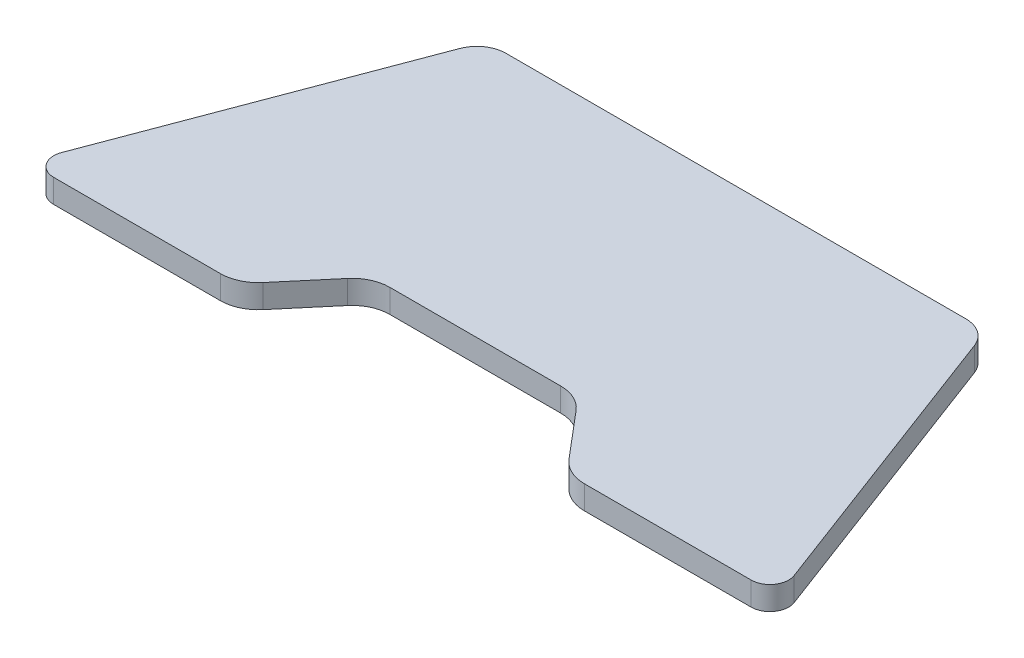
ISO-10303-21;
HEADER;
FILE_DESCRIPTION(('STEP AP214'),'2;1');
FILE_NAME('part.step','',(''),(''),'','','');
FILE_SCHEMA(('AUTOMOTIVE_DESIGN { 1 0 10303 214 1 1 1 1 }'));
ENDSEC;
DATA;
#1=APPLICATION_CONTEXT('core data for automotive mechanical design processes');
#2=APPLICATION_PROTOCOL_DEFINITION('international standard','automotive_design',2000,#1);
#3=PRODUCT_CONTEXT('',#1,'mechanical');
#4=PRODUCT('Part','Part','',(#3));
#5=PRODUCT_RELATED_PRODUCT_CATEGORY('part','',(#4));
#6=PRODUCT_DEFINITION_FORMATION('','',#4);
#7=PRODUCT_DEFINITION_CONTEXT('part definition',#1,'design');
#8=PRODUCT_DEFINITION('design','',#6,#7);
#9=PRODUCT_DEFINITION_SHAPE('','',#8);
#10=(LENGTH_UNIT() NAMED_UNIT(*) SI_UNIT(.MILLI.,.METRE.));
#11=(NAMED_UNIT(*) PLANE_ANGLE_UNIT() SI_UNIT($,.RADIAN.));
#12=(NAMED_UNIT(*) SI_UNIT($,.STERADIAN.) SOLID_ANGLE_UNIT());
#13=UNCERTAINTY_MEASURE_WITH_UNIT(LENGTH_MEASURE(1.E-05),#10,'distance_accuracy_value','');
#14=(GEOMETRIC_REPRESENTATION_CONTEXT(3) GLOBAL_UNCERTAINTY_ASSIGNED_CONTEXT((#13)) GLOBAL_UNIT_ASSIGNED_CONTEXT((#10,
#11,#12)) REPRESENTATION_CONTEXT('',''));
#15=CARTESIAN_POINT('',(0.,0.,0.));
#16=DIRECTION('',(0.,0.,1.));
#17=DIRECTION('',(1.,0.,0.));
#18=AXIS2_PLACEMENT_3D('',#15,#16,#17);
#19=CARTESIAN_POINT('',(0.,5.,-35.5));
#20=DIRECTION('',(0.,0.,-1.));
#21=DIRECTION('',(-1.,0.,0.));
#22=AXIS2_PLACEMENT_3D('',#19,#20,#21);
#23=PLANE('',#22);
#24=DIRECTION('',(1.,0.,0.));
#25=VECTOR('',#24,1.);
#26=CARTESIAN_POINT('',(0.,0.,-35.5));
#27=LINE('',#26,#25);
#28=CARTESIAN_POINT('',(-48.9397162412047,0.,-35.5));
#29=VERTEX_POINT('',#28);
#30=CARTESIAN_POINT('',(48.9397162412047,0.,-35.5));
#31=VERTEX_POINT('',#30);
#32=EDGE_CURVE('E180',#29,#31,#27,.T.);
#33=ORIENTED_EDGE('',*,*,#32,.F.);
#34=DIRECTION('',(0.,-1.,0.));
#35=VECTOR('',#34,1.);
#36=CARTESIAN_POINT('',(-48.9397162412047,5.,-35.5));
#37=LINE('',#36,#35);
#38=CARTESIAN_POINT('',(-48.9397162412047,5.,-35.5));
#39=VERTEX_POINT('',#38);
#40=EDGE_CURVE('E11',#39,#29,#37,.T.);
#41=ORIENTED_EDGE('',*,*,#40,.F.);
#42=DIRECTION('',(1.,0.,0.));
#43=VECTOR('',#42,1.);
#44=CARTESIAN_POINT('',(0.,5.,-35.5));
#45=LINE('',#44,#43);
#46=CARTESIAN_POINT('',(48.9397162412047,5.,-35.5));
#47=VERTEX_POINT('',#46);
#48=EDGE_CURVE('E223',#39,#47,#45,.T.);
#49=ORIENTED_EDGE('',*,*,#48,.T.);
#50=DIRECTION('',(0.,-1.,0.));
#51=VECTOR('',#50,1.);
#52=CARTESIAN_POINT('',(48.9397162412047,5.,-35.5));
#53=LINE('',#52,#51);
#54=EDGE_CURVE('E55',#47,#31,#53,.T.);
#55=ORIENTED_EDGE('',*,*,#54,.T.);
#56=EDGE_LOOP('',(#33,#41,#49,#55));
#57=FACE_BOUND('',#56,.T.);
#58=ADVANCED_FACE('F39',(#57),#23,.T.);
#59=CARTESIAN_POINT('',(-48.9397162412047,5.,-29.27));
#60=DIRECTION('',(0.,-1.,0.));
#61=DIRECTION('',(0.,0.,-1.));
#62=AXIS2_PLACEMENT_3D('',#59,#60,#61);
#63=CYLINDRICAL_SURFACE('',#62,6.23);
#64=CARTESIAN_POINT('',(-48.9397162412047,0.,-29.27));
#65=DIRECTION('',(0.,1.,0.));
#66=DIRECTION('',(0.,0.,1.));
#67=AXIS2_PLACEMENT_3D('',#64,#65,#66);
#68=CIRCLE('',#67,6.23);
#69=CARTESIAN_POINT('',(-54.7696656125678,0.,-31.4664950096333));
#70=VERTEX_POINT('',#69);
#71=EDGE_CURVE('E182',#29,#70,#68,.T.);
#72=ORIENTED_EDGE('',*,*,#71,.T.);
#73=DIRECTION('',(0.,-1.,0.));
#74=VECTOR('',#73,1.);
#75=CARTESIAN_POINT('',(-54.7696656125678,5.,-31.4664950096333));
#76=LINE('',#75,#74);
#77=CARTESIAN_POINT('',(-54.7696656125678,5.,-31.4664950096333));
#78=VERTEX_POINT('',#77);
#79=EDGE_CURVE('E47',#78,#70,#76,.T.);
#80=ORIENTED_EDGE('',*,*,#79,.F.);
#81=CARTESIAN_POINT('',(-48.9397162412047,5.,-29.27));
#82=DIRECTION('',(0.,1.,0.));
#83=DIRECTION('',(0.,0.,1.));
#84=AXIS2_PLACEMENT_3D('',#81,#82,#83);
#85=CIRCLE('',#84,6.23);
#86=EDGE_CURVE('E270',#39,#78,#85,.T.);
#87=ORIENTED_EDGE('',*,*,#86,.F.);
#88=ORIENTED_EDGE('',*,*,#40,.T.);
#89=EDGE_LOOP('',(#72,#80,#87,#88));
#90=FACE_BOUND('',#89,.T.);
#91=ADVANCED_FACE('F306',(#90),#63,.T.);
#92=CARTESIAN_POINT('',(-58.3432604093155,5.,-21.9814396612562));
#93=DIRECTION('',(0.935786415949122,0.,0.352567417276606));
#94=DIRECTION('',(0.352567417276606,0.,-0.935786415949122));
#95=AXIS2_PLACEMENT_3D('',#92,#93,#94);
#96=PLANE('',#95);
#97=DIRECTION('',(-0.352567417276606,0.,0.935786415949122));
#98=VECTOR('',#97,1.);
#99=CARTESIAN_POINT('',(-58.3432604093155,0.,-21.9814396612562));
#100=LINE('',#99,#98);
#101=CARTESIAN_POINT('',(-77.9616237514282,0.,30.0897303308935));
#102=VERTEX_POINT('',#101);
#103=EDGE_CURVE('E184',#70,#102,#100,.T.);
#104=ORIENTED_EDGE('',*,*,#103,.T.);
#105=DIRECTION('',(0.,-1.,0.));
#106=VECTOR('',#105,1.);
#107=CARTESIAN_POINT('',(-77.9616237514282,5.,30.0897303308935));
#108=LINE('',#107,#106);
#109=CARTESIAN_POINT('',(-77.9616237514282,5.,30.0897303308935));
#110=VERTEX_POINT('',#109);
#111=EDGE_CURVE('E245',#110,#102,#108,.T.);
#112=ORIENTED_EDGE('',*,*,#111,.F.);
#113=DIRECTION('',(-0.352567417276606,0.,0.935786415949122));
#114=VECTOR('',#113,1.);
#115=CARTESIAN_POINT('',(-58.3432604093155,5.,-21.9814396612562));
#116=LINE('',#115,#114);
#117=EDGE_CURVE('E253',#78,#110,#116,.T.);
#118=ORIENTED_EDGE('',*,*,#117,.F.);
#119=ORIENTED_EDGE('',*,*,#79,.T.);
#120=EDGE_LOOP('',(#104,#112,#118,#119));
#121=FACE_BOUND('',#120,.T.);
#122=ADVANCED_FACE('F251',(#121),#96,.F.);
#123=CARTESIAN_POINT('',(-74.2184780876317,5.,31.5));
#124=DIRECTION('',(0.,-1.,0.));
#125=DIRECTION('',(0.,0.,-1.));
#126=AXIS2_PLACEMENT_3D('',#123,#124,#125);
#127=CYLINDRICAL_SURFACE('',#126,4.);
#128=CARTESIAN_POINT('',(-74.2184780876317,0.,31.5));
#129=DIRECTION('',(0.,1.,0.));
#130=DIRECTION('',(0.,0.,1.));
#131=AXIS2_PLACEMENT_3D('',#128,#129,#130);
#132=CIRCLE('',#131,4.);
#133=CARTESIAN_POINT('',(-74.2184780876317,0.,35.5));
#134=VERTEX_POINT('',#133);
#135=EDGE_CURVE('E187',#134,#102,#132,.F.);
#136=ORIENTED_EDGE('',*,*,#135,.F.);
#137=DIRECTION('',(0.,-1.,0.));
#138=VECTOR('',#137,1.);
#139=CARTESIAN_POINT('',(-74.2184780876317,5.,35.5));
#140=LINE('',#139,#138);
#141=CARTESIAN_POINT('',(-74.2184780876317,5.,35.5));
#142=VERTEX_POINT('',#141);
#143=EDGE_CURVE('E243',#142,#134,#140,.T.);
#144=ORIENTED_EDGE('',*,*,#143,.F.);
#145=CARTESIAN_POINT('',(-74.2184780876317,5.,31.5));
#146=DIRECTION('',(0.,1.,0.));
#147=DIRECTION('',(0.,0.,1.));
#148=AXIS2_PLACEMENT_3D('',#145,#146,#147);
#149=CIRCLE('',#148,4.);
#150=EDGE_CURVE('E265',#142,#110,#149,.F.);
#151=ORIENTED_EDGE('',*,*,#150,.T.);
#152=ORIENTED_EDGE('',*,*,#111,.T.);
#153=EDGE_LOOP('',(#136,#144,#151,#152));
#154=FACE_BOUND('',#153,.T.);
#155=ADVANCED_FACE('F261',(#154),#127,.T.);
#156=CARTESIAN_POINT('',(0.,5.,35.5));
#157=DIRECTION('',(0.,0.,-1.));
#158=DIRECTION('',(-1.,0.,0.));
#159=AXIS2_PLACEMENT_3D('',#156,#157,#158);
#160=PLANE('',#159);
#161=DIRECTION('',(1.,0.,0.));
#162=VECTOR('',#161,1.);
#163=CARTESIAN_POINT('',(0.,0.,35.5));
#164=LINE('',#163,#162);
#165=CARTESIAN_POINT('',(-38.7609681740562,0.,35.5));
#166=VERTEX_POINT('',#165);
#167=EDGE_CURVE('E190',#134,#166,#164,.T.);
#168=ORIENTED_EDGE('',*,*,#167,.T.);
#169=DIRECTION('',(0.,-1.,0.));
#170=VECTOR('',#169,1.);
#171=CARTESIAN_POINT('',(-38.7609681740562,5.,35.5));
#172=LINE('',#171,#170);
#173=CARTESIAN_POINT('',(-38.7609681740562,5.,35.5));
#174=VERTEX_POINT('',#173);
#175=EDGE_CURVE('E241',#174,#166,#172,.T.);
#176=ORIENTED_EDGE('',*,*,#175,.F.);
#177=DIRECTION('',(1.,0.,0.));
#178=VECTOR('',#177,1.);
#179=CARTESIAN_POINT('',(0.,5.,35.5));
#180=LINE('',#179,#178);
#181=EDGE_CURVE('E266',#142,#174,#180,.T.);
#182=ORIENTED_EDGE('',*,*,#181,.F.);
#183=ORIENTED_EDGE('',*,*,#143,.T.);
#184=EDGE_LOOP('',(#168,#176,#182,#183));
#185=FACE_BOUND('',#184,.T.);
#186=ADVANCED_FACE('F317',(#185),#160,.F.);
#187=CARTESIAN_POINT('',(-38.7609681740562,5.,27.4));
#188=DIRECTION('',(0.,-1.,0.));
#189=DIRECTION('',(0.,0.,-1.));
#190=AXIS2_PLACEMENT_3D('',#187,#188,#189);
#191=CYLINDRICAL_SURFACE('',#190,8.1);
#192=CARTESIAN_POINT('',(-38.7609681740562,0.,27.4));
#193=DIRECTION('',(0.,1.,0.));
#194=DIRECTION('',(0.,0.,1.));
#195=AXIS2_PLACEMENT_3D('',#192,#193,#194);
#196=CIRCLE('',#195,8.1);
#197=CARTESIAN_POINT('',(-32.573080563163,0.,32.626858226024));
#198=VERTEX_POINT('',#197);
#199=EDGE_CURVE('E193',#198,#166,#196,.F.);
#200=ORIENTED_EDGE('',*,*,#199,.F.);
#201=DIRECTION('',(0.,-1.,0.));
#202=VECTOR('',#201,1.);
#203=CARTESIAN_POINT('',(-32.573080563163,5.,32.626858226024));
#204=LINE('',#203,#202);
#205=CARTESIAN_POINT('',(-32.573080563163,5.,32.626858226024));
#206=VERTEX_POINT('',#205);
#207=EDGE_CURVE('E239',#206,#198,#204,.T.);
#208=ORIENTED_EDGE('',*,*,#207,.F.);
#209=CARTESIAN_POINT('',(-38.7609681740562,5.,27.4));
#210=DIRECTION('',(0.,1.,0.));
#211=DIRECTION('',(0.,0.,1.));
#212=AXIS2_PLACEMENT_3D('',#209,#210,#211);
#213=CIRCLE('',#212,8.1);
#214=EDGE_CURVE('E268',#206,#174,#213,.F.);
#215=ORIENTED_EDGE('',*,*,#214,.T.);
#216=ORIENTED_EDGE('',*,*,#175,.T.);
#217=EDGE_LOOP('',(#200,#208,#215,#216));
#218=FACE_BOUND('',#217,.T.);
#219=ADVANCED_FACE('F320',(#218),#191,.T.);
#220=CARTESIAN_POINT('',(-2.92583993631155,5.,-2.47143314500702));
#221=DIRECTION('',(-0.763936742085573,0.,-0.645291139015313));
#222=DIRECTION('',(-0.645291139015313,0.,0.763936742085573));
#223=AXIS2_PLACEMENT_3D('',#220,#221,#222);
#224=PLANE('',#223);
#225=DIRECTION('',(0.645291139015313,0.,-0.763936742085573));
#226=VECTOR('',#225,1.);
#227=CARTESIAN_POINT('',(-2.92583993631155,0.,-2.47143314500702));
#228=LINE('',#227,#226);
#229=CARTESIAN_POINT('',(-24.3042338125517,0.,22.8376708878775));
#230=VERTEX_POINT('',#229);
#231=EDGE_CURVE('E196',#198,#230,#228,.T.);
#232=ORIENTED_EDGE('',*,*,#231,.T.);
#233=DIRECTION('',(0.,-1.,0.));
#234=VECTOR('',#233,1.);
#235=CARTESIAN_POINT('',(-24.3042338125517,5.,22.8376708878775));
#236=LINE('',#235,#234);
#237=CARTESIAN_POINT('',(-24.3042338125517,5.,22.8376708878775));
#238=VERTEX_POINT('',#237);
#239=EDGE_CURVE('E237',#238,#230,#236,.T.);
#240=ORIENTED_EDGE('',*,*,#239,.F.);
#241=DIRECTION('',(0.645291139015313,0.,-0.763936742085573));
#242=VECTOR('',#241,1.);
#243=CARTESIAN_POINT('',(-2.92583993631155,5.,-2.47143314500702));
#244=LINE('',#243,#242);
#245=EDGE_CURVE('E276',#206,#238,#244,.T.);
#246=ORIENTED_EDGE('',*,*,#245,.F.);
#247=ORIENTED_EDGE('',*,*,#207,.T.);
#248=EDGE_LOOP('',(#232,#240,#246,#247));
#249=FACE_BOUND('',#248,.T.);
#250=ADVANCED_FACE('F324',(#249),#224,.F.);
#251=CARTESIAN_POINT('',(-18.1927398758671,5.,28.));
#252=DIRECTION('',(0.,-1.,0.));
#253=DIRECTION('',(0.,0.,-1.));
#254=AXIS2_PLACEMENT_3D('',#251,#252,#253);
#255=CYLINDRICAL_SURFACE('',#254,8.);
#256=CARTESIAN_POINT('',(-18.1927398758671,0.,28.));
#257=DIRECTION('',(0.,1.,0.));
#258=DIRECTION('',(0.,0.,1.));
#259=AXIS2_PLACEMENT_3D('',#256,#257,#258);
#260=CIRCLE('',#259,8.);
#261=CARTESIAN_POINT('',(-18.1927398758671,0.,20.));
#262=VERTEX_POINT('',#261);
#263=EDGE_CURVE('E199',#262,#230,#260,.T.);
#264=ORIENTED_EDGE('',*,*,#263,.F.);
#265=DIRECTION('',(0.,-1.,0.));
#266=VECTOR('',#265,1.);
#267=CARTESIAN_POINT('',(-18.1927398758671,5.,20.));
#268=LINE('',#267,#266);
#269=CARTESIAN_POINT('',(-18.1927398758671,5.,20.));
#270=VERTEX_POINT('',#269);
#271=EDGE_CURVE('E235',#270,#262,#268,.T.);
#272=ORIENTED_EDGE('',*,*,#271,.F.);
#273=CARTESIAN_POINT('',(-18.1927398758671,5.,28.));
#274=DIRECTION('',(0.,1.,0.));
#275=DIRECTION('',(0.,0.,1.));
#276=AXIS2_PLACEMENT_3D('',#273,#274,#275);
#277=CIRCLE('',#276,8.);
#278=EDGE_CURVE('E278',#270,#238,#277,.T.);
#279=ORIENTED_EDGE('',*,*,#278,.T.);
#280=ORIENTED_EDGE('',*,*,#239,.T.);
#281=EDGE_LOOP('',(#264,#272,#279,#280));
#282=FACE_BOUND('',#281,.T.);
#283=ADVANCED_FACE('F328',(#282),#255,.F.);
#284=CARTESIAN_POINT('',(0.,5.,20.));
#285=DIRECTION('',(0.,0.,1.));
#286=DIRECTION('',(1.,0.,0.));
#287=AXIS2_PLACEMENT_3D('',#284,#285,#286);
#288=PLANE('',#287);
#289=DIRECTION('',(-1.,0.,0.));
#290=VECTOR('',#289,1.);
#291=CARTESIAN_POINT('',(0.,0.,20.));
#292=LINE('',#291,#290);
#293=CARTESIAN_POINT('',(18.1927398758671,0.,20.));
#294=VERTEX_POINT('',#293);
#295=EDGE_CURVE('E202',#294,#262,#292,.T.);
#296=ORIENTED_EDGE('',*,*,#295,.F.);
#297=DIRECTION('',(0.,-1.,0.));
#298=VECTOR('',#297,1.);
#299=CARTESIAN_POINT('',(18.1927398758671,5.,20.));
#300=LINE('',#299,#298);
#301=CARTESIAN_POINT('',(18.1927398758671,5.,20.));
#302=VERTEX_POINT('',#301);
#303=EDGE_CURVE('E233',#302,#294,#300,.T.);
#304=ORIENTED_EDGE('',*,*,#303,.F.);
#305=DIRECTION('',(-1.,0.,0.));
#306=VECTOR('',#305,1.);
#307=CARTESIAN_POINT('',(0.,5.,20.));
#308=LINE('',#307,#306);
#309=EDGE_CURVE('E281',#302,#270,#308,.T.);
#310=ORIENTED_EDGE('',*,*,#309,.T.);
#311=ORIENTED_EDGE('',*,*,#271,.T.);
#312=EDGE_LOOP('',(#296,#304,#310,#311));
#313=FACE_BOUND('',#312,.T.);
#314=ADVANCED_FACE('F332',(#313),#288,.T.);
#315=CARTESIAN_POINT('',(18.1927398758671,5.,28.));
#316=DIRECTION('',(0.,-1.,0.));
#317=DIRECTION('',(0.,0.,-1.));
#318=AXIS2_PLACEMENT_3D('',#315,#316,#317);
#319=CYLINDRICAL_SURFACE('',#318,8.);
#320=CARTESIAN_POINT('',(18.1927398758671,0.,28.));
#321=DIRECTION('',(0.,1.,0.));
#322=DIRECTION('',(0.,0.,1.));
#323=AXIS2_PLACEMENT_3D('',#320,#321,#322);
#324=CIRCLE('',#323,8.);
#325=CARTESIAN_POINT('',(24.3042338125517,0.,22.8376708878775));
#326=VERTEX_POINT('',#325);
#327=EDGE_CURVE('E205',#294,#326,#324,.F.);
#328=ORIENTED_EDGE('',*,*,#327,.T.);
#329=DIRECTION('',(0.,-1.,0.));
#330=VECTOR('',#329,1.);
#331=CARTESIAN_POINT('',(24.3042338125517,5.,22.8376708878775));
#332=LINE('',#331,#330);
#333=CARTESIAN_POINT('',(24.3042338125517,5.,22.8376708878775));
#334=VERTEX_POINT('',#333);
#335=EDGE_CURVE('E231',#334,#326,#332,.T.);
#336=ORIENTED_EDGE('',*,*,#335,.F.);
#337=CARTESIAN_POINT('',(18.1927398758671,5.,28.));
#338=DIRECTION('',(0.,1.,0.));
#339=DIRECTION('',(0.,0.,1.));
#340=AXIS2_PLACEMENT_3D('',#337,#338,#339);
#341=CIRCLE('',#340,8.);
#342=EDGE_CURVE('E284',#302,#334,#341,.F.);
#343=ORIENTED_EDGE('',*,*,#342,.F.);
#344=ORIENTED_EDGE('',*,*,#303,.T.);
#345=EDGE_LOOP('',(#328,#336,#343,#344));
#346=FACE_BOUND('',#345,.T.);
#347=ADVANCED_FACE('F336',(#346),#319,.F.);
#348=CARTESIAN_POINT('',(2.92583993631156,5.,-2.47143314500703));
#349=DIRECTION('',(-0.763936742085573,0.,0.645291139015313));
#350=DIRECTION('',(0.645291139015313,0.,0.763936742085573));
#351=AXIS2_PLACEMENT_3D('',#348,#349,#350);
#352=PLANE('',#351);
#353=DIRECTION('',(-0.645291139015313,0.,-0.763936742085573));
#354=VECTOR('',#353,1.);
#355=CARTESIAN_POINT('',(2.92583993631156,0.,-2.47143314500703));
#356=LINE('',#355,#354);
#357=CARTESIAN_POINT('',(32.573080563163,0.,32.626858226024));
#358=VERTEX_POINT('',#357);
#359=EDGE_CURVE('E208',#358,#326,#356,.T.);
#360=ORIENTED_EDGE('',*,*,#359,.F.);
#361=DIRECTION('',(0.,-1.,0.));
#362=VECTOR('',#361,1.);
#363=CARTESIAN_POINT('',(32.573080563163,5.,32.626858226024));
#364=LINE('',#363,#362);
#365=CARTESIAN_POINT('',(32.573080563163,5.,32.626858226024));
#366=VERTEX_POINT('',#365);
#367=EDGE_CURVE('E229',#366,#358,#364,.T.);
#368=ORIENTED_EDGE('',*,*,#367,.F.);
#369=DIRECTION('',(-0.645291139015313,0.,-0.763936742085573));
#370=VECTOR('',#369,1.);
#371=CARTESIAN_POINT('',(2.92583993631156,5.,-2.47143314500703));
#372=LINE('',#371,#370);
#373=EDGE_CURVE('E286',#366,#334,#372,.T.);
#374=ORIENTED_EDGE('',*,*,#373,.T.);
#375=ORIENTED_EDGE('',*,*,#335,.T.);
#376=EDGE_LOOP('',(#360,#368,#374,#375));
#377=FACE_BOUND('',#376,.T.);
#378=ADVANCED_FACE('F340',(#377),#352,.T.);
#379=CARTESIAN_POINT('',(38.7609681740562,5.,27.4));
#380=DIRECTION('',(0.,-1.,0.));
#381=DIRECTION('',(0.,0.,-1.));
#382=AXIS2_PLACEMENT_3D('',#379,#380,#381);
#383=CYLINDRICAL_SURFACE('',#382,8.10000000000001);
#384=CARTESIAN_POINT('',(38.7609681740562,0.,27.4));
#385=DIRECTION('',(0.,1.,0.));
#386=DIRECTION('',(0.,0.,1.));
#387=AXIS2_PLACEMENT_3D('',#384,#385,#386);
#388=CIRCLE('',#387,8.10000000000001);
#389=CARTESIAN_POINT('',(38.7609681740562,0.,35.5));
#390=VERTEX_POINT('',#389);
#391=EDGE_CURVE('E211',#358,#390,#388,.T.);
#392=ORIENTED_EDGE('',*,*,#391,.T.);
#393=DIRECTION('',(0.,-1.,0.));
#394=VECTOR('',#393,1.);
#395=CARTESIAN_POINT('',(38.7609681740562,5.,35.5));
#396=LINE('',#395,#394);
#397=CARTESIAN_POINT('',(38.7609681740562,5.,35.5));
#398=VERTEX_POINT('',#397);
#399=EDGE_CURVE('E227',#398,#390,#396,.T.);
#400=ORIENTED_EDGE('',*,*,#399,.F.);
#401=CARTESIAN_POINT('',(38.7609681740562,5.,27.4));
#402=DIRECTION('',(0.,1.,0.));
#403=DIRECTION('',(0.,0.,1.));
#404=AXIS2_PLACEMENT_3D('',#401,#402,#403);
#405=CIRCLE('',#404,8.10000000000001);
#406=EDGE_CURVE('E289',#366,#398,#405,.T.);
#407=ORIENTED_EDGE('',*,*,#406,.F.);
#408=ORIENTED_EDGE('',*,*,#367,.T.);
#409=EDGE_LOOP('',(#392,#400,#407,#408));
#410=FACE_BOUND('',#409,.T.);
#411=ADVANCED_FACE('F344',(#410),#383,.T.);
#412=CARTESIAN_POINT('',(0.,5.,35.5));
#413=DIRECTION('',(0.,0.,1.));
#414=DIRECTION('',(1.,0.,0.));
#415=AXIS2_PLACEMENT_3D('',#412,#413,#414);
#416=PLANE('',#415);
#417=DIRECTION('',(-1.,0.,0.));
#418=VECTOR('',#417,1.);
#419=CARTESIAN_POINT('',(0.,0.,35.5));
#420=LINE('',#419,#418);
#421=CARTESIAN_POINT('',(74.2184780876317,0.,35.5));
#422=VERTEX_POINT('',#421);
#423=EDGE_CURVE('E214',#422,#390,#420,.T.);
#424=ORIENTED_EDGE('',*,*,#423,.F.);
#425=DIRECTION('',(0.,-1.,0.));
#426=VECTOR('',#425,1.);
#427=CARTESIAN_POINT('',(74.2184780876317,5.,35.5));
#428=LINE('',#427,#426);
#429=CARTESIAN_POINT('',(74.2184780876317,5.,35.5));
#430=VERTEX_POINT('',#429);
#431=EDGE_CURVE('E172',#430,#422,#428,.T.);
#432=ORIENTED_EDGE('',*,*,#431,.F.);
#433=DIRECTION('',(-1.,0.,0.));
#434=VECTOR('',#433,1.);
#435=CARTESIAN_POINT('',(0.,5.,35.5));
#436=LINE('',#435,#434);
#437=EDGE_CURVE('E162',#430,#398,#436,.T.);
#438=ORIENTED_EDGE('',*,*,#437,.T.);
#439=ORIENTED_EDGE('',*,*,#399,.T.);
#440=EDGE_LOOP('',(#424,#432,#438,#439));
#441=FACE_BOUND('',#440,.T.);
#442=ADVANCED_FACE('F292',(#441),#416,.T.);
#443=CARTESIAN_POINT('',(74.2184780876317,5.,31.5));
#444=DIRECTION('',(0.,-1.,0.));
#445=DIRECTION('',(0.,0.,-1.));
#446=AXIS2_PLACEMENT_3D('',#443,#444,#445);
#447=CYLINDRICAL_SURFACE('',#446,3.99999999999997);
#448=CARTESIAN_POINT('',(74.2184780876317,0.,31.5));
#449=DIRECTION('',(0.,1.,0.));
#450=DIRECTION('',(0.,0.,1.));
#451=AXIS2_PLACEMENT_3D('',#448,#449,#450);
#452=CIRCLE('',#451,3.99999999999997);
#453=CARTESIAN_POINT('',(77.9616237514282,0.,30.0897303308935));
#454=VERTEX_POINT('',#453);
#455=EDGE_CURVE('E169',#422,#454,#452,.T.);
#456=ORIENTED_EDGE('',*,*,#455,.T.);
#457=DIRECTION('',(0.,-1.,0.));
#458=VECTOR('',#457,1.);
#459=CARTESIAN_POINT('',(77.9616237514282,5.,30.0897303308935));
#460=LINE('',#459,#458);
#461=CARTESIAN_POINT('',(77.9616237514282,5.,30.0897303308935));
#462=VERTEX_POINT('',#461);
#463=EDGE_CURVE('E166',#462,#454,#460,.T.);
#464=ORIENTED_EDGE('',*,*,#463,.F.);
#465=CARTESIAN_POINT('',(74.2184780876317,5.,31.5));
#466=DIRECTION('',(0.,1.,0.));
#467=DIRECTION('',(0.,0.,1.));
#468=AXIS2_PLACEMENT_3D('',#465,#466,#467);
#469=CIRCLE('',#468,3.99999999999997);
#470=EDGE_CURVE('E154',#430,#462,#469,.T.);
#471=ORIENTED_EDGE('',*,*,#470,.F.);
#472=ORIENTED_EDGE('',*,*,#431,.T.);
#473=EDGE_LOOP('',(#456,#464,#471,#472));
#474=FACE_BOUND('',#473,.T.);
#475=ADVANCED_FACE('F167',(#474),#447,.T.);
#476=CARTESIAN_POINT('',(58.3432604093155,5.,-21.9814396612562));
#477=DIRECTION('',(0.935786415949122,0.,-0.352567417276606));
#478=DIRECTION('',(-0.352567417276606,0.,-0.935786415949122));
#479=AXIS2_PLACEMENT_3D('',#476,#477,#478);
#480=PLANE('',#479);
#481=DIRECTION('',(0.352567417276606,0.,0.935786415949122));
#482=VECTOR('',#481,1.);
#483=CARTESIAN_POINT('',(58.3432604093155,0.,-21.9814396612562));
#484=LINE('',#483,#482);
#485=CARTESIAN_POINT('',(54.7696656125678,0.,-31.4664950096333));
#486=VERTEX_POINT('',#485);
#487=EDGE_CURVE('E218',#486,#454,#484,.T.);
#488=ORIENTED_EDGE('',*,*,#487,.F.);
#489=DIRECTION('',(0.,-1.,0.));
#490=VECTOR('',#489,1.);
#491=CARTESIAN_POINT('',(54.7696656125678,5.,-31.4664950096333));
#492=LINE('',#491,#490);
#493=CARTESIAN_POINT('',(54.7696656125678,5.,-31.4664950096333));
#494=VERTEX_POINT('',#493);
#495=EDGE_CURVE('E104',#494,#486,#492,.T.);
#496=ORIENTED_EDGE('',*,*,#495,.F.);
#497=DIRECTION('',(0.352567417276606,0.,0.935786415949122));
#498=VECTOR('',#497,1.);
#499=CARTESIAN_POINT('',(58.3432604093155,5.,-21.9814396612562));
#500=LINE('',#499,#498);
#501=EDGE_CURVE('E160',#494,#462,#500,.T.);
#502=ORIENTED_EDGE('',*,*,#501,.T.);
#503=ORIENTED_EDGE('',*,*,#463,.T.);
#504=EDGE_LOOP('',(#488,#496,#502,#503));
#505=FACE_BOUND('',#504,.T.);
#506=ADVANCED_FACE('F174',(#505),#480,.T.);
#507=CARTESIAN_POINT('',(48.9397162412047,5.,-29.27));
#508=DIRECTION('',(0.,-1.,0.));
#509=DIRECTION('',(0.,0.,-1.));
#510=AXIS2_PLACEMENT_3D('',#507,#508,#509);
#511=CYLINDRICAL_SURFACE('',#510,6.23);
#512=CARTESIAN_POINT('',(48.9397162412047,0.,-29.27));
#513=DIRECTION('',(0.,1.,0.));
#514=DIRECTION('',(0.,0.,1.));
#515=AXIS2_PLACEMENT_3D('',#512,#513,#514);
#516=CIRCLE('',#515,6.23);
#517=EDGE_CURVE('E220',#31,#486,#516,.F.);
#518=ORIENTED_EDGE('',*,*,#517,.F.);
#519=ORIENTED_EDGE('',*,*,#54,.F.);
#520=CARTESIAN_POINT('',(48.9397162412047,5.,-29.27));
#521=DIRECTION('',(0.,1.,0.));
#522=DIRECTION('',(0.,0.,1.));
#523=AXIS2_PLACEMENT_3D('',#520,#521,#522);
#524=CIRCLE('',#523,6.23);
#525=EDGE_CURVE('E175',#47,#494,#524,.F.);
#526=ORIENTED_EDGE('',*,*,#525,.T.);
#527=ORIENTED_EDGE('',*,*,#495,.T.);
#528=EDGE_LOOP('',(#518,#519,#526,#527));
#529=FACE_BOUND('',#528,.T.);
#530=ADVANCED_FACE('F295',(#529),#511,.T.);
#531=CARTESIAN_POINT('',(0.,5.,0.));
#532=DIRECTION('',(0.,1.,0.));
#533=DIRECTION('',(0.,0.,1.));
#534=AXIS2_PLACEMENT_3D('',#531,#532,#533);
#535=PLANE('',#534);
#536=ORIENTED_EDGE('',*,*,#48,.F.);
#537=ORIENTED_EDGE('',*,*,#86,.T.);
#538=ORIENTED_EDGE('',*,*,#117,.T.);
#539=ORIENTED_EDGE('',*,*,#150,.F.);
#540=ORIENTED_EDGE('',*,*,#181,.T.);
#541=ORIENTED_EDGE('',*,*,#214,.F.);
#542=ORIENTED_EDGE('',*,*,#245,.T.);
#543=ORIENTED_EDGE('',*,*,#278,.F.);
#544=ORIENTED_EDGE('',*,*,#309,.F.);
#545=ORIENTED_EDGE('',*,*,#342,.T.);
#546=ORIENTED_EDGE('',*,*,#373,.F.);
#547=ORIENTED_EDGE('',*,*,#406,.T.);
#548=ORIENTED_EDGE('',*,*,#437,.F.);
#549=ORIENTED_EDGE('',*,*,#470,.T.);
#550=ORIENTED_EDGE('',*,*,#501,.F.);
#551=ORIENTED_EDGE('',*,*,#525,.F.);
#552=EDGE_LOOP('',(#536,#537,#538,#539,#540,#541,#542,#543,#544,#545,#546,#547,#548,#549,#550,#551));
#553=FACE_BOUND('',#552,.T.);
#554=ADVANCED_FACE('F157',(#553),#535,.T.);
#555=CARTESIAN_POINT('',(0.,0.,0.));
#556=DIRECTION('',(0.,1.,0.));
#557=DIRECTION('',(0.,0.,1.));
#558=AXIS2_PLACEMENT_3D('',#555,#556,#557);
#559=PLANE('',#558);
#560=ORIENTED_EDGE('',*,*,#32,.T.);
#561=ORIENTED_EDGE('',*,*,#517,.T.);
#562=ORIENTED_EDGE('',*,*,#487,.T.);
#563=ORIENTED_EDGE('',*,*,#455,.F.);
#564=ORIENTED_EDGE('',*,*,#423,.T.);
#565=ORIENTED_EDGE('',*,*,#391,.F.);
#566=ORIENTED_EDGE('',*,*,#359,.T.);
#567=ORIENTED_EDGE('',*,*,#327,.F.);
#568=ORIENTED_EDGE('',*,*,#295,.T.);
#569=ORIENTED_EDGE('',*,*,#263,.T.);
#570=ORIENTED_EDGE('',*,*,#231,.F.);
#571=ORIENTED_EDGE('',*,*,#199,.T.);
#572=ORIENTED_EDGE('',*,*,#167,.F.);
#573=ORIENTED_EDGE('',*,*,#135,.T.);
#574=ORIENTED_EDGE('',*,*,#103,.F.);
#575=ORIENTED_EDGE('',*,*,#71,.F.);
#576=EDGE_LOOP('',(#560,#561,#562,#563,#564,#565,#566,#567,#568,#569,#570,#571,#572,#573,#574,#575));
#577=FACE_BOUND('',#576,.T.);
#578=ADVANCED_FACE('F257',(#577),#559,.F.);
#579=CLOSED_SHELL('',(#58,#91,#122,#155,#186,#219,#250,#283,#314,#347,#378,#411,#442,#475,#506,
#530,#554,#578));
#580=MANIFOLD_SOLID_BREP('B2',#579);
#581=ADVANCED_BREP_SHAPE_REPRESENTATION('',(#18,#580),#14);
#582=SHAPE_DEFINITION_REPRESENTATION(#9,#581);
ENDSEC;
END-ISO-10303-21;
